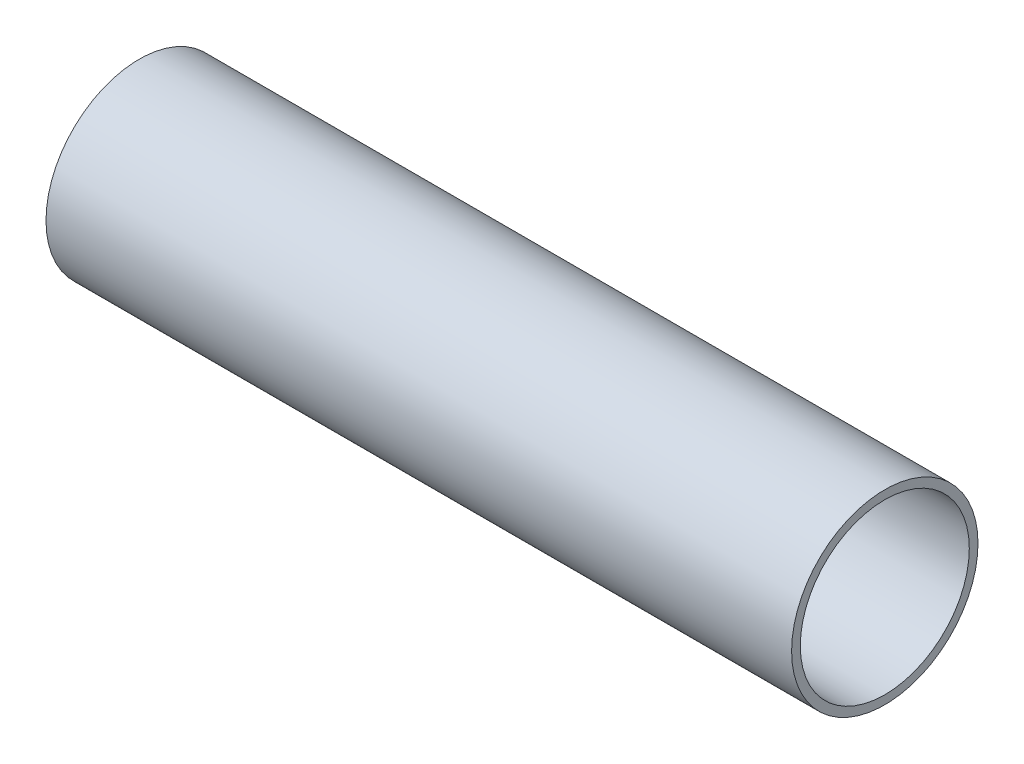
ISO-10303-21;
HEADER;
FILE_DESCRIPTION(('STEP AP214'),'2;1');
FILE_NAME('part.step','',(''),(''),'','','');
FILE_SCHEMA(('AUTOMOTIVE_DESIGN { 1 0 10303 214 1 1 1 1 }'));
ENDSEC;
DATA;
#1=APPLICATION_CONTEXT('core data for automotive mechanical design processes');
#2=APPLICATION_PROTOCOL_DEFINITION('international standard','automotive_design',2000,#1);
#3=PRODUCT_CONTEXT('',#1,'mechanical');
#4=PRODUCT('Part','Part','',(#3));
#5=PRODUCT_RELATED_PRODUCT_CATEGORY('part','',(#4));
#6=PRODUCT_DEFINITION_FORMATION('','',#4);
#7=PRODUCT_DEFINITION_CONTEXT('part definition',#1,'design');
#8=PRODUCT_DEFINITION('design','',#6,#7);
#9=PRODUCT_DEFINITION_SHAPE('','',#8);
#10=(LENGTH_UNIT() NAMED_UNIT(*) SI_UNIT(.MILLI.,.METRE.));
#11=(NAMED_UNIT(*) PLANE_ANGLE_UNIT() SI_UNIT($,.RADIAN.));
#12=(NAMED_UNIT(*) SI_UNIT($,.STERADIAN.) SOLID_ANGLE_UNIT());
#13=UNCERTAINTY_MEASURE_WITH_UNIT(LENGTH_MEASURE(1.E-05),#10,'distance_accuracy_value','');
#14=(GEOMETRIC_REPRESENTATION_CONTEXT(3) GLOBAL_UNCERTAINTY_ASSIGNED_CONTEXT((#13)) GLOBAL_UNIT_ASSIGNED_CONTEXT((#10,
#11,#12)) REPRESENTATION_CONTEXT('',''));
#15=CARTESIAN_POINT('',(0.,0.,0.));
#16=DIRECTION('',(0.,0.,1.));
#17=DIRECTION('',(1.,0.,0.));
#18=AXIS2_PLACEMENT_3D('',#15,#16,#17);
#19=CARTESIAN_POINT('',(0.,0.,-8.63599999999999));
#20=DIRECTION('',(1.,0.,0.));
#21=DIRECTION('',(0.,0.,-1.));
#22=AXIS2_PLACEMENT_3D('',#19,#20,#21);
#23=PLANE('',#22);
#24=CARTESIAN_POINT('',(0.,0.,0.));
#25=DIRECTION('',(-1.,0.,0.));
#26=DIRECTION('',(0.,0.,1.));
#27=AXIS2_PLACEMENT_3D('',#24,#25,#26);
#28=CIRCLE('',#27,8.63599999999999);
#29=CARTESIAN_POINT('',(0.,0.,8.63599999999999));
#30=VERTEX_POINT('',#29);
#31=EDGE_CURVE('E43',#30,#30,#28,.T.);
#32=ORIENTED_EDGE('',*,*,#31,.F.);
#33=EDGE_LOOP('',(#32));
#34=FACE_BOUND('',#33,.T.);
#35=CARTESIAN_POINT('',(0.,0.,0.));
#36=DIRECTION('',(-1.,0.,0.));
#37=DIRECTION('',(0.,0.,1.));
#38=AXIS2_PLACEMENT_3D('',#35,#36,#37);
#39=CIRCLE('',#38,9.525);
#40=CARTESIAN_POINT('',(0.,0.,9.525));
#41=VERTEX_POINT('',#40);
#42=EDGE_CURVE('E10',#41,#41,#39,.T.);
#43=ORIENTED_EDGE('',*,*,#42,.T.);
#44=EDGE_LOOP('',(#43));
#45=FACE_BOUND('',#44,.T.);
#46=ADVANCED_FACE('F29',(#34,#45),#23,.F.);
#47=CARTESIAN_POINT('',(0.,0.,0.));
#48=DIRECTION('',(-1.,0.,0.));
#49=DIRECTION('',(0.,0.,1.));
#50=AXIS2_PLACEMENT_3D('',#47,#48,#49);
#51=CYLINDRICAL_SURFACE('',#50,9.525);
#52=ORIENTED_EDGE('',*,*,#42,.F.);
#53=EDGE_LOOP('',(#52));
#54=FACE_BOUND('',#53,.T.);
#55=CARTESIAN_POINT('',(76.2,0.,0.));
#56=DIRECTION('',(-1.,0.,0.));
#57=DIRECTION('',(0.,0.,1.));
#58=AXIS2_PLACEMENT_3D('',#55,#56,#57);
#59=CIRCLE('',#58,9.525);
#60=CARTESIAN_POINT('',(76.2,0.,9.525));
#61=VERTEX_POINT('',#60);
#62=EDGE_CURVE('E35',#61,#61,#59,.T.);
#63=ORIENTED_EDGE('',*,*,#62,.T.);
#64=EDGE_LOOP('',(#63));
#65=FACE_BOUND('',#64,.T.);
#66=ADVANCED_FACE('F52',(#54,#65),#51,.T.);
#67=CARTESIAN_POINT('',(76.2,0.,-9.525));
#68=DIRECTION('',(-1.,0.,0.));
#69=DIRECTION('',(0.,0.,1.));
#70=AXIS2_PLACEMENT_3D('',#67,#68,#69);
#71=PLANE('',#70);
#72=ORIENTED_EDGE('',*,*,#62,.F.);
#73=EDGE_LOOP('',(#72));
#74=FACE_BOUND('',#73,.T.);
#75=CARTESIAN_POINT('',(76.2,0.,0.));
#76=DIRECTION('',(-1.,0.,0.));
#77=DIRECTION('',(0.,0.,1.));
#78=AXIS2_PLACEMENT_3D('',#75,#76,#77);
#79=CIRCLE('',#78,8.63599999999999);
#80=CARTESIAN_POINT('',(76.2,0.,8.63599999999999));
#81=VERTEX_POINT('',#80);
#82=EDGE_CURVE('E39',#81,#81,#79,.T.);
#83=ORIENTED_EDGE('',*,*,#82,.T.);
#84=EDGE_LOOP('',(#83));
#85=FACE_BOUND('',#84,.T.);
#86=ADVANCED_FACE('F56',(#74,#85),#71,.F.);
#87=CARTESIAN_POINT('',(0.,0.,0.));
#88=DIRECTION('',(-1.,0.,0.));
#89=DIRECTION('',(0.,0.,1.));
#90=AXIS2_PLACEMENT_3D('',#87,#88,#89);
#91=CYLINDRICAL_SURFACE('',#90,8.63599999999999);
#92=ORIENTED_EDGE('',*,*,#82,.F.);
#93=EDGE_LOOP('',(#92));
#94=FACE_BOUND('',#93,.T.);
#95=ORIENTED_EDGE('',*,*,#31,.T.);
#96=EDGE_LOOP('',(#95));
#97=FACE_BOUND('',#96,.T.);
#98=ADVANCED_FACE('F49',(#94,#97),#91,.F.);
#99=CLOSED_SHELL('',(#46,#66,#86,#98));
#100=MANIFOLD_SOLID_BREP('B2',#99);
#101=ADVANCED_BREP_SHAPE_REPRESENTATION('',(#18,#100),#14);
#102=SHAPE_DEFINITION_REPRESENTATION(#9,#101);
ENDSEC;
END-ISO-10303-21;
